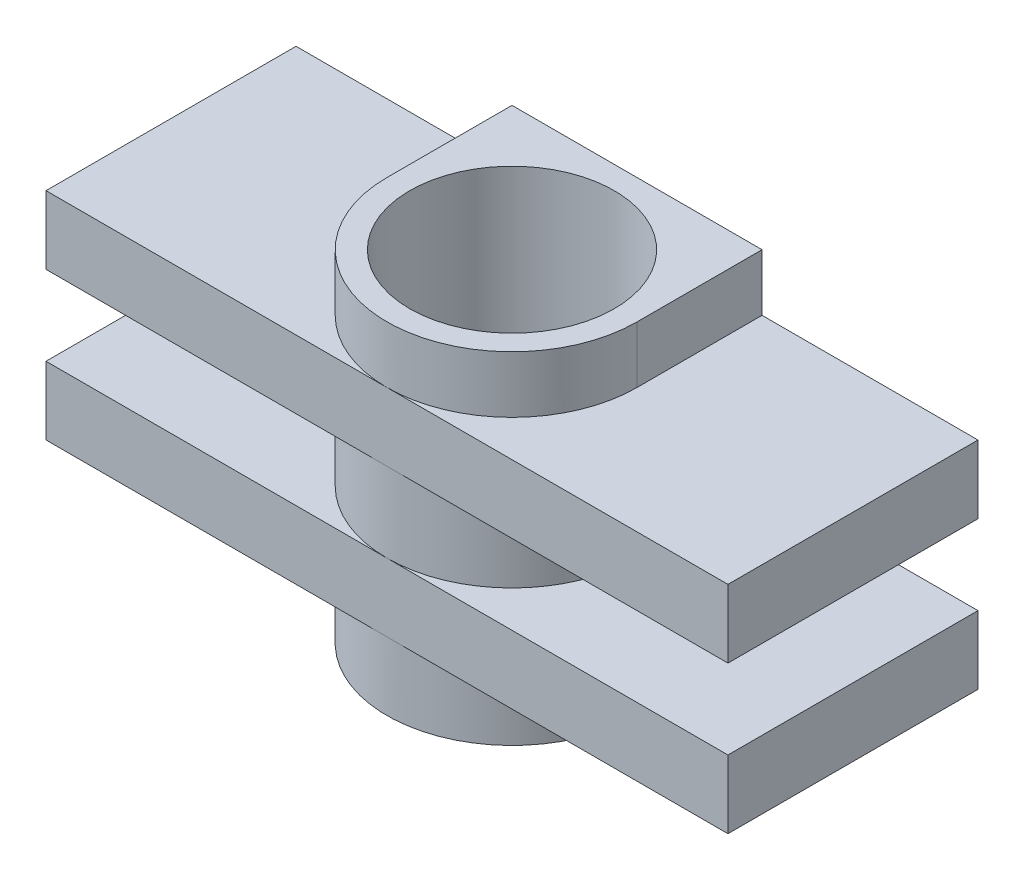
ISO-10303-21;
HEADER;
FILE_DESCRIPTION(('STEP AP214'),'2;1');
FILE_NAME('part.step','',(''),(''),'','','');
FILE_SCHEMA(('AUTOMOTIVE_DESIGN { 1 0 10303 214 1 1 1 1 }'));
ENDSEC;
DATA;
#1=APPLICATION_CONTEXT('core data for automotive mechanical design processes');
#2=APPLICATION_PROTOCOL_DEFINITION('international standard','automotive_design',2000,#1);
#3=PRODUCT_CONTEXT('',#1,'mechanical');
#4=PRODUCT('Part','Part','',(#3));
#5=PRODUCT_RELATED_PRODUCT_CATEGORY('part','',(#4));
#6=PRODUCT_DEFINITION_FORMATION('','',#4);
#7=PRODUCT_DEFINITION_CONTEXT('part definition',#1,'design');
#8=PRODUCT_DEFINITION('design','',#6,#7);
#9=PRODUCT_DEFINITION_SHAPE('','',#8);
#10=(LENGTH_UNIT() NAMED_UNIT(*) SI_UNIT(.MILLI.,.METRE.));
#11=(NAMED_UNIT(*) PLANE_ANGLE_UNIT() SI_UNIT($,.RADIAN.));
#12=(NAMED_UNIT(*) SI_UNIT($,.STERADIAN.) SOLID_ANGLE_UNIT());
#13=UNCERTAINTY_MEASURE_WITH_UNIT(LENGTH_MEASURE(1.E-05),#10,'distance_accuracy_value','');
#14=(GEOMETRIC_REPRESENTATION_CONTEXT(3) GLOBAL_UNCERTAINTY_ASSIGNED_CONTEXT((#13)) GLOBAL_UNIT_ASSIGNED_CONTEXT((#10,
#11,#12)) REPRESENTATION_CONTEXT('',''));
#15=CARTESIAN_POINT('',(0.,0.,0.));
#16=DIRECTION('',(0.,0.,1.));
#17=DIRECTION('',(1.,0.,0.));
#18=AXIS2_PLACEMENT_3D('',#15,#16,#17);
#19=CARTESIAN_POINT('',(-5.5,15.,-5.5));
#20=DIRECTION('',(0.,0.,1.));
#21=DIRECTION('',(1.,0.,0.));
#22=AXIS2_PLACEMENT_3D('',#19,#20,#21);
#23=PLANE('',#22);
#24=DIRECTION('',(-1.,0.,0.));
#25=VECTOR('',#24,1.);
#26=CARTESIAN_POINT('',(15.,6.,-5.5));
#27=LINE('',#26,#25);
#28=CARTESIAN_POINT('',(0.,6.,-5.5));
#29=VERTEX_POINT('',#28);
#30=CARTESIAN_POINT('',(-15.,6.,-5.5));
#31=VERTEX_POINT('',#30);
#32=EDGE_CURVE('E246',#29,#31,#27,.T.);
#33=ORIENTED_EDGE('',*,*,#32,.F.);
#34=CARTESIAN_POINT('',(15.,6.,-5.5));
#35=VERTEX_POINT('',#34);
#36=EDGE_CURVE('E48',#35,#29,#27,.T.);
#37=ORIENTED_EDGE('',*,*,#36,.F.);
#38=DIRECTION('',(0.,1.,0.));
#39=VECTOR('',#38,1.);
#40=CARTESIAN_POINT('',(15.,3.,-5.5));
#41=LINE('',#40,#39);
#42=CARTESIAN_POINT('',(15.,3.,-5.5));
#43=VERTEX_POINT('',#42);
#44=EDGE_CURVE('E252',#43,#35,#41,.T.);
#45=ORIENTED_EDGE('',*,*,#44,.F.);
#46=DIRECTION('',(-1.,0.,0.));
#47=VECTOR('',#46,1.);
#48=CARTESIAN_POINT('',(15.,3.,-5.5));
#49=LINE('',#48,#47);
#50=CARTESIAN_POINT('',(5.5,3.,-5.5));
#51=VERTEX_POINT('',#50);
#52=EDGE_CURVE('E234',#43,#51,#49,.T.);
#53=ORIENTED_EDGE('',*,*,#52,.T.);
#54=DIRECTION('',(0.,-1.,0.));
#55=VECTOR('',#54,1.);
#56=CARTESIAN_POINT('',(5.5,15.,-5.5));
#57=LINE('',#56,#55);
#58=CARTESIAN_POINT('',(5.5,0.,-5.5));
#59=VERTEX_POINT('',#58);
#60=EDGE_CURVE('E295',#51,#59,#57,.T.);
#61=ORIENTED_EDGE('',*,*,#60,.T.);
#62=DIRECTION('',(-1.,0.,0.));
#63=VECTOR('',#62,1.);
#64=CARTESIAN_POINT('',(-5.5,0.,-5.5));
#65=LINE('',#64,#63);
#66=CARTESIAN_POINT('',(-5.5,0.,-5.5));
#67=VERTEX_POINT('',#66);
#68=EDGE_CURVE('E283',#59,#67,#65,.T.);
#69=ORIENTED_EDGE('',*,*,#68,.T.);
#70=DIRECTION('',(0.,-1.,0.));
#71=VECTOR('',#70,1.);
#72=CARTESIAN_POINT('',(-5.5,15.,-5.5));
#73=LINE('',#72,#71);
#74=CARTESIAN_POINT('',(-5.5,3.,-5.5));
#75=VERTEX_POINT('',#74);
#76=EDGE_CURVE('E291',#75,#67,#73,.T.);
#77=ORIENTED_EDGE('',*,*,#76,.F.);
#78=CARTESIAN_POINT('',(-15.,3.,-5.5));
#79=VERTEX_POINT('',#78);
#80=EDGE_CURVE('E233',#75,#79,#49,.T.);
#81=ORIENTED_EDGE('',*,*,#80,.T.);
#82=DIRECTION('',(0.,1.,0.));
#83=VECTOR('',#82,1.);
#84=CARTESIAN_POINT('',(-15.,3.,-5.5));
#85=LINE('',#84,#83);
#86=EDGE_CURVE('E248',#79,#31,#85,.T.);
#87=ORIENTED_EDGE('',*,*,#86,.T.);
#88=EDGE_LOOP('',(#33,#37,#45,#53,#61,#69,#77,#81,#87));
#89=FACE_BOUND('',#88,.T.);
#90=ADVANCED_FACE('F33',(#89),#23,.F.);
#91=CARTESIAN_POINT('',(0.,15.,0.));
#92=DIRECTION('',(0.,-1.,0.));
#93=DIRECTION('',(0.,0.,-1.));
#94=AXIS2_PLACEMENT_3D('',#91,#92,#93);
#95=CYLINDRICAL_SURFACE('',#94,5.5);
#96=CARTESIAN_POINT('',(0.,9.5,0.));
#97=DIRECTION('',(0.,1.,0.));
#98=DIRECTION('',(0.,0.,1.));
#99=AXIS2_PLACEMENT_3D('',#96,#97,#98);
#100=CIRCLE('',#99,5.5);
#101=CARTESIAN_POINT('',(0.,9.5,5.5));
#102=VERTEX_POINT('',#101);
#103=CARTESIAN_POINT('',(5.5,9.5,0.));
#104=VERTEX_POINT('',#103);
#105=EDGE_CURVE('E208',#102,#104,#100,.T.);
#106=ORIENTED_EDGE('',*,*,#105,.F.);
#107=CARTESIAN_POINT('',(-5.5,9.5,0.));
#108=VERTEX_POINT('',#107);
#109=EDGE_CURVE('E204',#108,#102,#100,.T.);
#110=ORIENTED_EDGE('',*,*,#109,.F.);
#111=DIRECTION('',(0.,-1.,0.));
#112=VECTOR('',#111,1.);
#113=CARTESIAN_POINT('',(-5.5,15.,0.));
#114=LINE('',#113,#112);
#115=CARTESIAN_POINT('',(-5.5,6.,0.));
#116=VERTEX_POINT('',#115);
#117=EDGE_CURVE('E292',#108,#116,#114,.T.);
#118=ORIENTED_EDGE('',*,*,#117,.T.);
#119=CARTESIAN_POINT('',(0.,6.,0.));
#120=DIRECTION('',(0.,-1.,0.));
#121=DIRECTION('',(0.,0.,-1.));
#122=AXIS2_PLACEMENT_3D('',#119,#120,#121);
#123=CIRCLE('',#122,5.5);
#124=CARTESIAN_POINT('',(0.,6.,5.5));
#125=VERTEX_POINT('',#124);
#126=EDGE_CURVE('E251',#125,#116,#123,.T.);
#127=ORIENTED_EDGE('',*,*,#126,.F.);
#128=CARTESIAN_POINT('',(5.5,6.,0.));
#129=VERTEX_POINT('',#128);
#130=EDGE_CURVE('E260',#129,#125,#123,.T.);
#131=ORIENTED_EDGE('',*,*,#130,.F.);
#132=DIRECTION('',(0.,-1.,0.));
#133=VECTOR('',#132,1.);
#134=CARTESIAN_POINT('',(5.5,15.,0.));
#135=LINE('',#134,#133);
#136=EDGE_CURVE('E304',#104,#129,#135,.T.);
#137=ORIENTED_EDGE('',*,*,#136,.F.);
#138=EDGE_LOOP('',(#106,#110,#118,#127,#131,#137));
#139=FACE_BOUND('',#138,.T.);
#140=ADVANCED_FACE('F321',(#139),#95,.T.);
#141=CARTESIAN_POINT('',(0.,12.5,0.));
#142=DIRECTION('',(0.,1.,0.));
#143=DIRECTION('',(0.,0.,1.));
#144=AXIS2_PLACEMENT_3D('',#141,#142,#143);
#145=CIRCLE('',#144,5.5);
#146=CARTESIAN_POINT('',(-5.5,12.5,0.));
#147=VERTEX_POINT('',#146);
#148=CARTESIAN_POINT('',(0.,12.5,5.5));
#149=VERTEX_POINT('',#148);
#150=EDGE_CURVE('E217',#147,#149,#145,.T.);
#151=ORIENTED_EDGE('',*,*,#150,.T.);
#152=CARTESIAN_POINT('',(5.5,12.5,0.));
#153=VERTEX_POINT('',#152);
#154=EDGE_CURVE('E219',#149,#153,#145,.T.);
#155=ORIENTED_EDGE('',*,*,#154,.T.);
#156=CARTESIAN_POINT('',(5.5,15.,0.));
#157=VERTEX_POINT('',#156);
#158=EDGE_CURVE('E300',#157,#153,#135,.T.);
#159=ORIENTED_EDGE('',*,*,#158,.F.);
#160=CARTESIAN_POINT('',(0.,15.,0.));
#161=DIRECTION('',(0.,1.,0.));
#162=DIRECTION('',(0.,0.,1.));
#163=AXIS2_PLACEMENT_3D('',#160,#161,#162);
#164=CIRCLE('',#163,5.5);
#165=CARTESIAN_POINT('',(-5.5,15.,0.));
#166=VERTEX_POINT('',#165);
#167=EDGE_CURVE('E267',#166,#157,#164,.T.);
#168=ORIENTED_EDGE('',*,*,#167,.F.);
#169=EDGE_CURVE('E288',#166,#147,#114,.T.);
#170=ORIENTED_EDGE('',*,*,#169,.T.);
#171=EDGE_LOOP('',(#151,#155,#159,#168,#170));
#172=FACE_BOUND('',#171,.T.);
#173=ADVANCED_FACE('F387',(#172),#95,.T.);
#174=CARTESIAN_POINT('',(5.5,15.,-5.5));
#175=DIRECTION('',(-1.,0.,0.));
#176=DIRECTION('',(0.,0.,1.));
#177=AXIS2_PLACEMENT_3D('',#174,#175,#176);
#178=PLANE('',#177);
#179=ORIENTED_EDGE('',*,*,#158,.T.);
#180=DIRECTION('',(0.,0.,-1.));
#181=VECTOR('',#180,1.);
#182=CARTESIAN_POINT('',(5.5,12.5,-5.5));
#183=LINE('',#182,#181);
#184=CARTESIAN_POINT('',(5.5,12.5,-5.5));
#185=VERTEX_POINT('',#184);
#186=EDGE_CURVE('E220',#153,#185,#183,.T.);
#187=ORIENTED_EDGE('',*,*,#186,.T.);
#188=CARTESIAN_POINT('',(5.5,15.,-5.5));
#189=VERTEX_POINT('',#188);
#190=EDGE_CURVE('E296',#189,#185,#57,.T.);
#191=ORIENTED_EDGE('',*,*,#190,.F.);
#192=DIRECTION('',(0.,0.,-1.));
#193=VECTOR('',#192,1.);
#194=CARTESIAN_POINT('',(5.5,15.,-5.5));
#195=LINE('',#194,#193);
#196=EDGE_CURVE('E270',#157,#189,#195,.T.);
#197=ORIENTED_EDGE('',*,*,#196,.F.);
#198=EDGE_LOOP('',(#179,#187,#191,#197));
#199=FACE_BOUND('',#198,.T.);
#200=ADVANCED_FACE('F397',(#199),#178,.F.);
#201=CARTESIAN_POINT('',(-5.5,15.,0.));
#202=DIRECTION('',(1.,0.,0.));
#203=DIRECTION('',(0.,0.,-1.));
#204=AXIS2_PLACEMENT_3D('',#201,#202,#203);
#205=PLANE('',#204);
#206=CARTESIAN_POINT('',(-5.5,15.,-5.5));
#207=VERTEX_POINT('',#206);
#208=CARTESIAN_POINT('',(-5.5,12.5,-5.5));
#209=VERTEX_POINT('',#208);
#210=EDGE_CURVE('E293',#207,#209,#73,.T.);
#211=ORIENTED_EDGE('',*,*,#210,.T.);
#212=DIRECTION('',(0.,0.,1.));
#213=VECTOR('',#212,1.);
#214=CARTESIAN_POINT('',(-5.5,12.5,0.));
#215=LINE('',#214,#213);
#216=EDGE_CURVE('E215',#209,#147,#215,.T.);
#217=ORIENTED_EDGE('',*,*,#216,.T.);
#218=ORIENTED_EDGE('',*,*,#169,.F.);
#219=DIRECTION('',(0.,0.,1.));
#220=VECTOR('',#219,1.);
#221=CARTESIAN_POINT('',(-5.5,15.,0.));
#222=LINE('',#221,#220);
#223=EDGE_CURVE('E275',#207,#166,#222,.T.);
#224=ORIENTED_EDGE('',*,*,#223,.F.);
#225=EDGE_LOOP('',(#211,#217,#218,#224));
#226=FACE_BOUND('',#225,.T.);
#227=ADVANCED_FACE('F396',(#226),#205,.F.);
#228=CARTESIAN_POINT('',(5.5,3.,0.));
#229=VERTEX_POINT('',#228);
#230=CARTESIAN_POINT('',(5.5,0.,0.));
#231=VERTEX_POINT('',#230);
#232=EDGE_CURVE('E299',#229,#231,#135,.T.);
#233=ORIENTED_EDGE('',*,*,#232,.F.);
#234=CARTESIAN_POINT('',(0.,3.,0.));
#235=DIRECTION('',(0.,-1.,0.));
#236=DIRECTION('',(0.,0.,-1.));
#237=AXIS2_PLACEMENT_3D('',#234,#235,#236);
#238=CIRCLE('',#237,5.5);
#239=CARTESIAN_POINT('',(0.,3.,5.5));
#240=VERTEX_POINT('',#239);
#241=EDGE_CURVE('E263',#229,#240,#238,.T.);
#242=ORIENTED_EDGE('',*,*,#241,.T.);
#243=CARTESIAN_POINT('',(-5.5,3.,0.));
#244=VERTEX_POINT('',#243);
#245=EDGE_CURVE('E261',#240,#244,#238,.T.);
#246=ORIENTED_EDGE('',*,*,#245,.T.);
#247=CARTESIAN_POINT('',(-5.5,0.,0.));
#248=VERTEX_POINT('',#247);
#249=EDGE_CURVE('E277',#244,#248,#114,.T.);
#250=ORIENTED_EDGE('',*,*,#249,.T.);
#251=CARTESIAN_POINT('',(0.,0.,0.));
#252=DIRECTION('',(0.,1.,0.));
#253=DIRECTION('',(0.,0.,1.));
#254=AXIS2_PLACEMENT_3D('',#251,#252,#253);
#255=CIRCLE('',#254,5.5);
#256=EDGE_CURVE('E266',#248,#231,#255,.T.);
#257=ORIENTED_EDGE('',*,*,#256,.T.);
#258=EDGE_LOOP('',(#233,#242,#246,#250,#257));
#259=FACE_BOUND('',#258,.T.);
#260=ADVANCED_FACE('F337',(#259),#95,.T.);
#261=ORIENTED_EDGE('',*,*,#60,.F.);
#262=DIRECTION('',(0.,0.,1.));
#263=VECTOR('',#262,1.);
#264=CARTESIAN_POINT('',(5.5,3.,-5.5));
#265=LINE('',#264,#263);
#266=EDGE_CURVE('E264',#51,#229,#265,.T.);
#267=ORIENTED_EDGE('',*,*,#266,.T.);
#268=ORIENTED_EDGE('',*,*,#232,.T.);
#269=DIRECTION('',(0.,0.,-1.));
#270=VECTOR('',#269,1.);
#271=CARTESIAN_POINT('',(5.5,0.,-5.5));
#272=LINE('',#271,#270);
#273=EDGE_CURVE('E280',#231,#59,#272,.T.);
#274=ORIENTED_EDGE('',*,*,#273,.T.);
#275=EDGE_LOOP('',(#261,#267,#268,#274));
#276=FACE_BOUND('',#275,.T.);
#277=ADVANCED_FACE('F328',(#276),#178,.F.);
#278=DIRECTION('',(-1.,0.,0.));
#279=VECTOR('',#278,1.);
#280=CARTESIAN_POINT('',(15.,9.5,-5.5));
#281=LINE('',#280,#279);
#282=CARTESIAN_POINT('',(15.,9.5,-5.5));
#283=VERTEX_POINT('',#282);
#284=CARTESIAN_POINT('',(0.,9.5,-5.5));
#285=VERTEX_POINT('',#284);
#286=EDGE_CURVE('E56',#283,#285,#281,.T.);
#287=ORIENTED_EDGE('',*,*,#286,.T.);
#288=CARTESIAN_POINT('',(-15.,9.5,-5.5));
#289=VERTEX_POINT('',#288);
#290=EDGE_CURVE('E433',#285,#289,#281,.T.);
#291=ORIENTED_EDGE('',*,*,#290,.T.);
#292=DIRECTION('',(0.,-1.,0.));
#293=VECTOR('',#292,1.);
#294=CARTESIAN_POINT('',(-15.,12.5,-5.5));
#295=LINE('',#294,#293);
#296=CARTESIAN_POINT('',(-15.,12.5,-5.5));
#297=VERTEX_POINT('',#296);
#298=EDGE_CURVE('E421',#297,#289,#295,.T.);
#299=ORIENTED_EDGE('',*,*,#298,.F.);
#300=DIRECTION('',(-1.,0.,0.));
#301=VECTOR('',#300,1.);
#302=CARTESIAN_POINT('',(15.,12.5,-5.5));
#303=LINE('',#302,#301);
#304=EDGE_CURVE('E196',#209,#297,#303,.T.);
#305=ORIENTED_EDGE('',*,*,#304,.F.);
#306=ORIENTED_EDGE('',*,*,#210,.F.);
#307=DIRECTION('',(-1.,0.,0.));
#308=VECTOR('',#307,1.);
#309=CARTESIAN_POINT('',(-5.5,15.,-5.5));
#310=LINE('',#309,#308);
#311=EDGE_CURVE('E273',#189,#207,#310,.T.);
#312=ORIENTED_EDGE('',*,*,#311,.F.);
#313=ORIENTED_EDGE('',*,*,#190,.T.);
#314=CARTESIAN_POINT('',(15.,12.5,-5.5));
#315=VERTEX_POINT('',#314);
#316=EDGE_CURVE('E418',#315,#185,#303,.T.);
#317=ORIENTED_EDGE('',*,*,#316,.F.);
#318=DIRECTION('',(0.,-1.,0.));
#319=VECTOR('',#318,1.);
#320=CARTESIAN_POINT('',(15.,12.5,-5.5));
#321=LINE('',#320,#319);
#322=EDGE_CURVE('E211',#315,#283,#321,.T.);
#323=ORIENTED_EDGE('',*,*,#322,.T.);
#324=EDGE_LOOP('',(#287,#291,#299,#305,#306,#312,#313,#317,#323));
#325=FACE_BOUND('',#324,.T.);
#326=ADVANCED_FACE('F383',(#325),#23,.F.);
#327=ORIENTED_EDGE('',*,*,#249,.F.);
#328=DIRECTION('',(0.,0.,-1.));
#329=VECTOR('',#328,1.);
#330=CARTESIAN_POINT('',(-5.5,3.,0.));
#331=LINE('',#330,#329);
#332=EDGE_CURVE('E303',#244,#75,#331,.T.);
#333=ORIENTED_EDGE('',*,*,#332,.T.);
#334=ORIENTED_EDGE('',*,*,#76,.T.);
#335=DIRECTION('',(0.,0.,1.));
#336=VECTOR('',#335,1.);
#337=CARTESIAN_POINT('',(-5.5,0.,0.));
#338=LINE('',#337,#336);
#339=EDGE_CURVE('E271',#67,#248,#338,.T.);
#340=ORIENTED_EDGE('',*,*,#339,.T.);
#341=EDGE_LOOP('',(#327,#333,#334,#340));
#342=FACE_BOUND('',#341,.T.);
#343=ADVANCED_FACE('F342',(#342),#205,.F.);
#344=CARTESIAN_POINT('',(0.,15.,0.));
#345=DIRECTION('',(0.,1.,0.));
#346=DIRECTION('',(0.,0.,1.));
#347=AXIS2_PLACEMENT_3D('',#344,#345,#346);
#348=PLANE('',#347);
#349=CARTESIAN_POINT('',(0.,15.,0.));
#350=DIRECTION('',(0.,1.,0.));
#351=DIRECTION('',(0.,0.,1.));
#352=AXIS2_PLACEMENT_3D('',#349,#350,#351);
#353=CIRCLE('',#352,4.5);
#354=CARTESIAN_POINT('',(0.,15.,4.5));
#355=VERTEX_POINT('',#354);
#356=EDGE_CURVE('E479',#355,#355,#353,.T.);
#357=ORIENTED_EDGE('',*,*,#356,.F.);
#358=EDGE_LOOP('',(#357));
#359=FACE_BOUND('',#358,.T.);
#360=ORIENTED_EDGE('',*,*,#167,.T.);
#361=ORIENTED_EDGE('',*,*,#196,.T.);
#362=ORIENTED_EDGE('',*,*,#311,.T.);
#363=ORIENTED_EDGE('',*,*,#223,.T.);
#364=EDGE_LOOP('',(#360,#361,#362,#363));
#365=FACE_BOUND('',#364,.T.);
#366=ADVANCED_FACE('F376',(#359,#365),#348,.T.);
#367=CARTESIAN_POINT('',(0.,0.,0.));
#368=DIRECTION('',(0.,1.,0.));
#369=DIRECTION('',(0.,0.,1.));
#370=AXIS2_PLACEMENT_3D('',#367,#368,#369);
#371=PLANE('',#370);
#372=CARTESIAN_POINT('',(0.,0.,0.));
#373=DIRECTION('',(0.,1.,0.));
#374=DIRECTION('',(0.,0.,1.));
#375=AXIS2_PLACEMENT_3D('',#372,#373,#374);
#376=CIRCLE('',#375,4.5);
#377=CARTESIAN_POINT('',(0.,0.,4.5));
#378=VERTEX_POINT('',#377);
#379=EDGE_CURVE('E428',#378,#378,#376,.T.);
#380=ORIENTED_EDGE('',*,*,#379,.T.);
#381=EDGE_LOOP('',(#380));
#382=FACE_BOUND('',#381,.T.);
#383=ORIENTED_EDGE('',*,*,#256,.F.);
#384=ORIENTED_EDGE('',*,*,#339,.F.);
#385=ORIENTED_EDGE('',*,*,#68,.F.);
#386=ORIENTED_EDGE('',*,*,#273,.F.);
#387=EDGE_LOOP('',(#383,#384,#385,#386));
#388=FACE_BOUND('',#387,.T.);
#389=ADVANCED_FACE('F335',(#382,#388),#371,.F.);
#390=CARTESIAN_POINT('',(15.,3.,5.5));
#391=DIRECTION('',(0.,0.,1.));
#392=DIRECTION('',(1.,0.,0.));
#393=AXIS2_PLACEMENT_3D('',#390,#391,#392);
#394=PLANE('',#393);
#395=DIRECTION('',(1.,0.,0.));
#396=VECTOR('',#395,1.);
#397=CARTESIAN_POINT('',(15.,3.,5.5));
#398=LINE('',#397,#396);
#399=CARTESIAN_POINT('',(-15.,3.,5.5));
#400=VERTEX_POINT('',#399);
#401=EDGE_CURVE('E227',#400,#240,#398,.T.);
#402=ORIENTED_EDGE('',*,*,#401,.T.);
#403=CARTESIAN_POINT('',(15.,3.,5.5));
#404=VERTEX_POINT('',#403);
#405=EDGE_CURVE('E226',#240,#404,#398,.T.);
#406=ORIENTED_EDGE('',*,*,#405,.T.);
#407=DIRECTION('',(0.,1.,0.));
#408=VECTOR('',#407,1.);
#409=CARTESIAN_POINT('',(15.,3.,5.5));
#410=LINE('',#409,#408);
#411=CARTESIAN_POINT('',(15.,6.,5.5));
#412=VERTEX_POINT('',#411);
#413=EDGE_CURVE('E254',#404,#412,#410,.T.);
#414=ORIENTED_EDGE('',*,*,#413,.T.);
#415=DIRECTION('',(1.,0.,0.));
#416=VECTOR('',#415,1.);
#417=CARTESIAN_POINT('',(15.,6.,5.5));
#418=LINE('',#417,#416);
#419=EDGE_CURVE('E240',#125,#412,#418,.T.);
#420=ORIENTED_EDGE('',*,*,#419,.F.);
#421=CARTESIAN_POINT('',(-15.,6.,5.5));
#422=VERTEX_POINT('',#421);
#423=EDGE_CURVE('E241',#422,#125,#418,.T.);
#424=ORIENTED_EDGE('',*,*,#423,.F.);
#425=DIRECTION('',(0.,1.,0.));
#426=VECTOR('',#425,1.);
#427=CARTESIAN_POINT('',(-15.,3.,5.5));
#428=LINE('',#427,#426);
#429=EDGE_CURVE('E237',#400,#422,#428,.T.);
#430=ORIENTED_EDGE('',*,*,#429,.F.);
#431=EDGE_LOOP('',(#402,#406,#414,#420,#424,#430));
#432=FACE_BOUND('',#431,.T.);
#433=ADVANCED_FACE('F368',(#432),#394,.T.);
#434=CARTESIAN_POINT('',(0.,3.,0.));
#435=DIRECTION('',(0.,-1.,0.));
#436=DIRECTION('',(0.,0.,-1.));
#437=AXIS2_PLACEMENT_3D('',#434,#435,#436);
#438=PLANE('',#437);
#439=ORIENTED_EDGE('',*,*,#266,.F.);
#440=ORIENTED_EDGE('',*,*,#52,.F.);
#441=DIRECTION('',(0.,0.,-1.));
#442=VECTOR('',#441,1.);
#443=CARTESIAN_POINT('',(15.,3.,-5.5));
#444=LINE('',#443,#442);
#445=EDGE_CURVE('E230',#404,#43,#444,.T.);
#446=ORIENTED_EDGE('',*,*,#445,.F.);
#447=ORIENTED_EDGE('',*,*,#405,.F.);
#448=ORIENTED_EDGE('',*,*,#241,.F.);
#449=EDGE_LOOP('',(#439,#440,#446,#447,#448));
#450=FACE_BOUND('',#449,.T.);
#451=ADVANCED_FACE('F348',(#450),#438,.T.);
#452=ORIENTED_EDGE('',*,*,#245,.F.);
#453=ORIENTED_EDGE('',*,*,#401,.F.);
#454=DIRECTION('',(0.,0.,1.));
#455=VECTOR('',#454,1.);
#456=CARTESIAN_POINT('',(-15.,3.,-5.5));
#457=LINE('',#456,#455);
#458=EDGE_CURVE('E223',#79,#400,#457,.T.);
#459=ORIENTED_EDGE('',*,*,#458,.F.);
#460=ORIENTED_EDGE('',*,*,#80,.F.);
#461=ORIENTED_EDGE('',*,*,#332,.F.);
#462=EDGE_LOOP('',(#452,#453,#459,#460,#461));
#463=FACE_BOUND('',#462,.T.);
#464=ADVANCED_FACE('F353',(#463),#438,.T.);
#465=CARTESIAN_POINT('',(0.,6.,0.));
#466=DIRECTION('',(0.,-1.,0.));
#467=DIRECTION('',(0.,0.,-1.));
#468=AXIS2_PLACEMENT_3D('',#465,#466,#467);
#469=PLANE('',#468);
#470=ORIENTED_EDGE('',*,*,#36,.T.);
#471=CARTESIAN_POINT('',(0.,6.,0.));
#472=DIRECTION('',(0.,-1.,0.));
#473=DIRECTION('',(0.,0.,-1.));
#474=AXIS2_PLACEMENT_3D('',#471,#472,#473);
#475=CIRCLE('',#474,5.5);
#476=EDGE_CURVE('E41',#29,#129,#475,.T.);
#477=ORIENTED_EDGE('',*,*,#476,.T.);
#478=ORIENTED_EDGE('',*,*,#130,.T.);
#479=ORIENTED_EDGE('',*,*,#419,.T.);
#480=DIRECTION('',(0.,0.,-1.));
#481=VECTOR('',#480,1.);
#482=CARTESIAN_POINT('',(15.,6.,-5.5));
#483=LINE('',#482,#481);
#484=EDGE_CURVE('E244',#412,#35,#483,.T.);
#485=ORIENTED_EDGE('',*,*,#484,.T.);
#486=EDGE_LOOP('',(#470,#477,#478,#479,#485));
#487=FACE_BOUND('',#486,.T.);
#488=ADVANCED_FACE('F315',(#487),#469,.F.);
#489=ORIENTED_EDGE('',*,*,#423,.T.);
#490=ORIENTED_EDGE('',*,*,#126,.T.);
#491=CARTESIAN_POINT('',(0.,6.,0.));
#492=DIRECTION('',(0.,-1.,0.));
#493=DIRECTION('',(0.,0.,-1.));
#494=AXIS2_PLACEMENT_3D('',#491,#492,#493);
#495=CIRCLE('',#494,5.5);
#496=EDGE_CURVE('E309',#116,#29,#495,.T.);
#497=ORIENTED_EDGE('',*,*,#496,.T.);
#498=ORIENTED_EDGE('',*,*,#32,.T.);
#499=DIRECTION('',(0.,0.,1.));
#500=VECTOR('',#499,1.);
#501=CARTESIAN_POINT('',(-15.,6.,-5.5));
#502=LINE('',#501,#500);
#503=EDGE_CURVE('E222',#31,#422,#502,.T.);
#504=ORIENTED_EDGE('',*,*,#503,.T.);
#505=EDGE_LOOP('',(#489,#490,#497,#498,#504));
#506=FACE_BOUND('',#505,.T.);
#507=ADVANCED_FACE('F361',(#506),#469,.F.);
#508=CARTESIAN_POINT('',(-15.,3.,-5.5));
#509=DIRECTION('',(-1.,0.,0.));
#510=DIRECTION('',(0.,0.,1.));
#511=AXIS2_PLACEMENT_3D('',#508,#509,#510);
#512=PLANE('',#511);
#513=ORIENTED_EDGE('',*,*,#503,.F.);
#514=ORIENTED_EDGE('',*,*,#86,.F.);
#515=ORIENTED_EDGE('',*,*,#458,.T.);
#516=ORIENTED_EDGE('',*,*,#429,.T.);
#517=EDGE_LOOP('',(#513,#514,#515,#516));
#518=FACE_BOUND('',#517,.T.);
#519=ADVANCED_FACE('F358',(#518),#512,.T.);
#520=CARTESIAN_POINT('',(15.,3.,-5.5));
#521=DIRECTION('',(1.,0.,0.));
#522=DIRECTION('',(0.,0.,-1.));
#523=AXIS2_PLACEMENT_3D('',#520,#521,#522);
#524=PLANE('',#523);
#525=ORIENTED_EDGE('',*,*,#484,.F.);
#526=ORIENTED_EDGE('',*,*,#413,.F.);
#527=ORIENTED_EDGE('',*,*,#445,.T.);
#528=ORIENTED_EDGE('',*,*,#44,.T.);
#529=EDGE_LOOP('',(#525,#526,#527,#528));
#530=FACE_BOUND('',#529,.T.);
#531=ADVANCED_FACE('F366',(#530),#524,.T.);
#532=CARTESIAN_POINT('',(15.,12.5,5.5));
#533=DIRECTION('',(0.,0.,-1.));
#534=DIRECTION('',(-1.,0.,0.));
#535=AXIS2_PLACEMENT_3D('',#532,#533,#534);
#536=PLANE('',#535);
#537=DIRECTION('',(1.,0.,0.));
#538=VECTOR('',#537,1.);
#539=CARTESIAN_POINT('',(15.,12.5,5.5));
#540=LINE('',#539,#538);
#541=CARTESIAN_POINT('',(15.,12.5,5.5));
#542=VERTEX_POINT('',#541);
#543=EDGE_CURVE('E186',#149,#542,#540,.T.);
#544=ORIENTED_EDGE('',*,*,#543,.F.);
#545=CARTESIAN_POINT('',(-15.,12.5,5.5));
#546=VERTEX_POINT('',#545);
#547=EDGE_CURVE('E178',#546,#149,#540,.T.);
#548=ORIENTED_EDGE('',*,*,#547,.F.);
#549=DIRECTION('',(0.,-1.,0.));
#550=VECTOR('',#549,1.);
#551=CARTESIAN_POINT('',(-15.,12.5,5.5));
#552=LINE('',#551,#550);
#553=CARTESIAN_POINT('',(-15.,9.5,5.5));
#554=VERTEX_POINT('',#553);
#555=EDGE_CURVE('E183',#546,#554,#552,.T.);
#556=ORIENTED_EDGE('',*,*,#555,.T.);
#557=DIRECTION('',(1.,0.,0.));
#558=VECTOR('',#557,1.);
#559=CARTESIAN_POINT('',(15.,9.5,5.5));
#560=LINE('',#559,#558);
#561=EDGE_CURVE('E429',#554,#102,#560,.T.);
#562=ORIENTED_EDGE('',*,*,#561,.T.);
#563=CARTESIAN_POINT('',(15.,9.5,5.5));
#564=VERTEX_POINT('',#563);
#565=EDGE_CURVE('E427',#102,#564,#560,.T.);
#566=ORIENTED_EDGE('',*,*,#565,.T.);
#567=DIRECTION('',(0.,-1.,0.));
#568=VECTOR('',#567,1.);
#569=CARTESIAN_POINT('',(15.,12.5,5.5));
#570=LINE('',#569,#568);
#571=EDGE_CURVE('E205',#542,#564,#570,.T.);
#572=ORIENTED_EDGE('',*,*,#571,.F.);
#573=EDGE_LOOP('',(#544,#548,#556,#562,#566,#572));
#574=FACE_BOUND('',#573,.T.);
#575=ADVANCED_FACE('F180',(#574),#536,.F.);
#576=CARTESIAN_POINT('',(0.,12.5,0.));
#577=DIRECTION('',(0.,1.,0.));
#578=DIRECTION('',(0.,0.,1.));
#579=AXIS2_PLACEMENT_3D('',#576,#577,#578);
#580=PLANE('',#579);
#581=ORIENTED_EDGE('',*,*,#186,.F.);
#582=ORIENTED_EDGE('',*,*,#154,.F.);
#583=ORIENTED_EDGE('',*,*,#543,.T.);
#584=DIRECTION('',(0.,0.,-1.));
#585=VECTOR('',#584,1.);
#586=CARTESIAN_POINT('',(15.,12.5,5.5));
#587=LINE('',#586,#585);
#588=EDGE_CURVE('E189',#542,#315,#587,.T.);
#589=ORIENTED_EDGE('',*,*,#588,.T.);
#590=ORIENTED_EDGE('',*,*,#316,.T.);
#591=EDGE_LOOP('',(#581,#582,#583,#589,#590));
#592=FACE_BOUND('',#591,.T.);
#593=ADVANCED_FACE('F416',(#592),#580,.T.);
#594=ORIENTED_EDGE('',*,*,#150,.F.);
#595=ORIENTED_EDGE('',*,*,#216,.F.);
#596=ORIENTED_EDGE('',*,*,#304,.T.);
#597=DIRECTION('',(0.,0.,1.));
#598=VECTOR('',#597,1.);
#599=CARTESIAN_POINT('',(-15.,12.5,5.5));
#600=LINE('',#599,#598);
#601=EDGE_CURVE('E192',#297,#546,#600,.T.);
#602=ORIENTED_EDGE('',*,*,#601,.T.);
#603=ORIENTED_EDGE('',*,*,#547,.T.);
#604=EDGE_LOOP('',(#594,#595,#596,#602,#603));
#605=FACE_BOUND('',#604,.T.);
#606=ADVANCED_FACE('F193',(#605),#580,.T.);
#607=CARTESIAN_POINT('',(0.,9.5,0.));
#608=DIRECTION('',(0.,1.,0.));
#609=DIRECTION('',(0.,0.,1.));
#610=AXIS2_PLACEMENT_3D('',#607,#608,#609);
#611=PLANE('',#610);
#612=ORIENTED_EDGE('',*,*,#105,.T.);
#613=CARTESIAN_POINT('',(0.,9.5,0.));
#614=DIRECTION('',(0.,1.,0.));
#615=DIRECTION('',(0.,0.,1.));
#616=AXIS2_PLACEMENT_3D('',#613,#614,#615);
#617=CIRCLE('',#616,5.5);
#618=EDGE_CURVE('E11',#104,#285,#617,.T.);
#619=ORIENTED_EDGE('',*,*,#618,.T.);
#620=ORIENTED_EDGE('',*,*,#286,.F.);
#621=DIRECTION('',(0.,0.,-1.));
#622=VECTOR('',#621,1.);
#623=CARTESIAN_POINT('',(15.,9.5,5.5));
#624=LINE('',#623,#622);
#625=EDGE_CURVE('E431',#564,#283,#624,.T.);
#626=ORIENTED_EDGE('',*,*,#625,.F.);
#627=ORIENTED_EDGE('',*,*,#565,.F.);
#628=EDGE_LOOP('',(#612,#619,#620,#626,#627));
#629=FACE_BOUND('',#628,.T.);
#630=ADVANCED_FACE('F437',(#629),#611,.F.);
#631=ORIENTED_EDGE('',*,*,#290,.F.);
#632=CARTESIAN_POINT('',(0.,9.5,0.));
#633=DIRECTION('',(0.,1.,0.));
#634=DIRECTION('',(0.,0.,1.));
#635=AXIS2_PLACEMENT_3D('',#632,#633,#634);
#636=CIRCLE('',#635,5.5);
#637=EDGE_CURVE('E312',#285,#108,#636,.T.);
#638=ORIENTED_EDGE('',*,*,#637,.T.);
#639=ORIENTED_EDGE('',*,*,#109,.T.);
#640=ORIENTED_EDGE('',*,*,#561,.F.);
#641=DIRECTION('',(0.,0.,1.));
#642=VECTOR('',#641,1.);
#643=CARTESIAN_POINT('',(-15.,9.5,5.5));
#644=LINE('',#643,#642);
#645=EDGE_CURVE('E203',#289,#554,#644,.T.);
#646=ORIENTED_EDGE('',*,*,#645,.F.);
#647=EDGE_LOOP('',(#631,#638,#639,#640,#646));
#648=FACE_BOUND('',#647,.T.);
#649=ADVANCED_FACE('F442',(#648),#611,.F.);
#650=CARTESIAN_POINT('',(-15.,12.5,5.5));
#651=DIRECTION('',(1.,0.,0.));
#652=DIRECTION('',(0.,0.,-1.));
#653=AXIS2_PLACEMENT_3D('',#650,#651,#652);
#654=PLANE('',#653);
#655=ORIENTED_EDGE('',*,*,#645,.T.);
#656=ORIENTED_EDGE('',*,*,#555,.F.);
#657=ORIENTED_EDGE('',*,*,#601,.F.);
#658=ORIENTED_EDGE('',*,*,#298,.T.);
#659=EDGE_LOOP('',(#655,#656,#657,#658));
#660=FACE_BOUND('',#659,.T.);
#661=ADVANCED_FACE('F201',(#660),#654,.F.);
#662=CARTESIAN_POINT('',(15.,12.5,5.5));
#663=DIRECTION('',(-1.,0.,0.));
#664=DIRECTION('',(0.,0.,1.));
#665=AXIS2_PLACEMENT_3D('',#662,#663,#664);
#666=PLANE('',#665);
#667=ORIENTED_EDGE('',*,*,#625,.T.);
#668=ORIENTED_EDGE('',*,*,#322,.F.);
#669=ORIENTED_EDGE('',*,*,#588,.F.);
#670=ORIENTED_EDGE('',*,*,#571,.T.);
#671=EDGE_LOOP('',(#667,#668,#669,#670));
#672=FACE_BOUND('',#671,.T.);
#673=ADVANCED_FACE('F447',(#672),#666,.F.);
#674=CARTESIAN_POINT('',(0.,0.,0.));
#675=DIRECTION('',(0.,1.,0.));
#676=DIRECTION('',(0.,0.,1.));
#677=AXIS2_PLACEMENT_3D('',#674,#675,#676);
#678=CYLINDRICAL_SURFACE('',#677,4.5);
#679=ORIENTED_EDGE('',*,*,#379,.F.);
#680=EDGE_LOOP('',(#679));
#681=FACE_BOUND('',#680,.T.);
#682=ORIENTED_EDGE('',*,*,#356,.T.);
#683=EDGE_LOOP('',(#682));
#684=FACE_BOUND('',#683,.T.);
#685=ADVANCED_FACE('F449',(#681,#684),#678,.F.);
#686=CARTESIAN_POINT('',(0.,15.,0.));
#687=DIRECTION('',(0.,-1.,0.));
#688=DIRECTION('',(0.,0.,-1.));
#689=AXIS2_PLACEMENT_3D('',#686,#687,#688);
#690=CYLINDRICAL_SURFACE('',#689,5.5);
#691=ORIENTED_EDGE('',*,*,#637,.F.);
#692=DIRECTION('',(0.,-1.,0.));
#693=VECTOR('',#692,1.);
#694=CARTESIAN_POINT('',(0.,15.,-5.5));
#695=LINE('',#694,#693);
#696=EDGE_CURVE('E306',#29,#285,#695,.F.);
#697=ORIENTED_EDGE('',*,*,#696,.F.);
#698=ORIENTED_EDGE('',*,*,#496,.F.);
#699=ORIENTED_EDGE('',*,*,#117,.F.);
#700=EDGE_LOOP('',(#691,#697,#698,#699));
#701=FACE_BOUND('',#700,.T.);
#702=ADVANCED_FACE('F446',(#701),#690,.T.);
#703=CARTESIAN_POINT('',(0.,15.,0.));
#704=DIRECTION('',(0.,-1.,0.));
#705=DIRECTION('',(0.,0.,-1.));
#706=AXIS2_PLACEMENT_3D('',#703,#704,#705);
#707=CYLINDRICAL_SURFACE('',#706,5.5);
#708=ORIENTED_EDGE('',*,*,#618,.F.);
#709=ORIENTED_EDGE('',*,*,#136,.T.);
#710=ORIENTED_EDGE('',*,*,#476,.F.);
#711=ORIENTED_EDGE('',*,*,#696,.T.);
#712=EDGE_LOOP('',(#708,#709,#710,#711));
#713=FACE_BOUND('',#712,.T.);
#714=ADVANCED_FACE('F35',(#713),#707,.T.);
#715=CLOSED_SHELL('',(#90,#140,#173,#200,#227,#260,#277,#326,#343,#366,#389,#433,#451,#464,#488,
#507,#519,#531,#575,#593,#606,#630,#649,#661,#673,#685,#702,#714));
#716=MANIFOLD_SOLID_BREP('B2',#715);
#717=ADVANCED_BREP_SHAPE_REPRESENTATION('',(#18,#716),#14);
#718=SHAPE_DEFINITION_REPRESENTATION(#9,#717);
ENDSEC;
END-ISO-10303-21;
